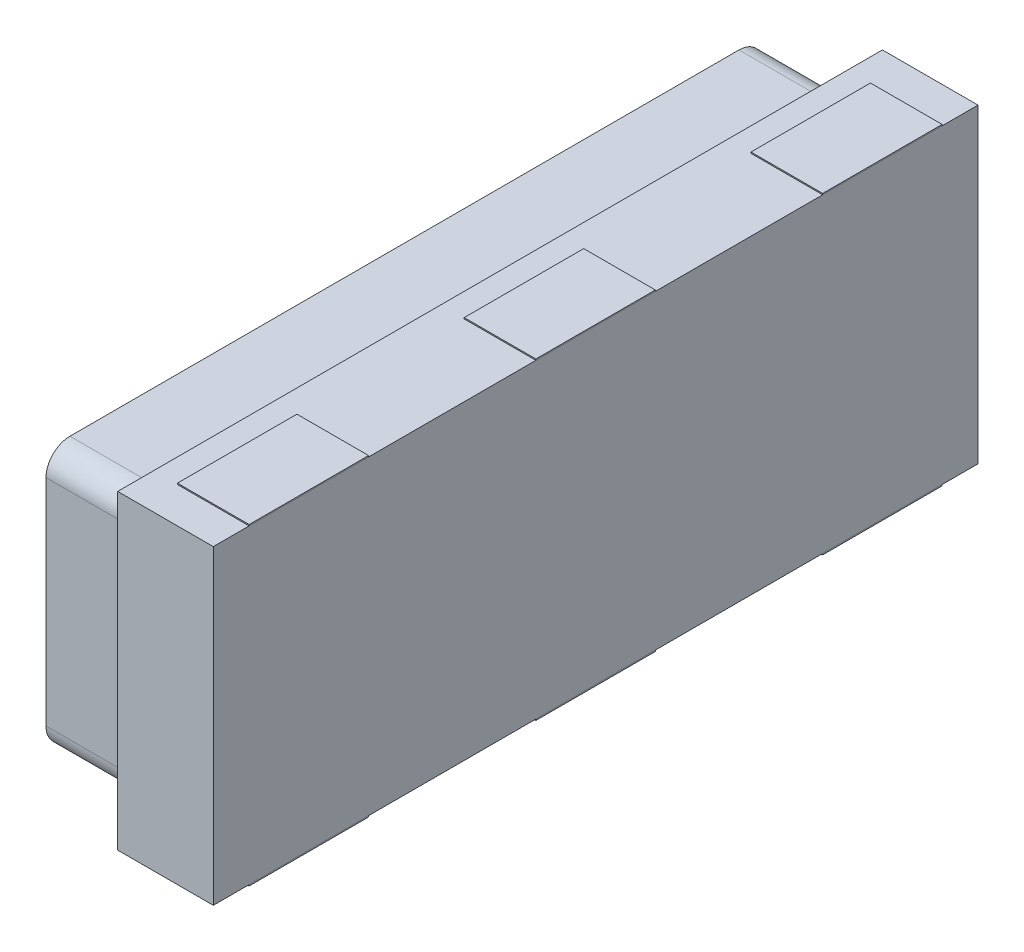
ISO-10303-21;
HEADER;
FILE_DESCRIPTION(('STEP AP214'),'2;1');
FILE_NAME('part.step','',(''),(''),'','','');
FILE_SCHEMA(('AUTOMOTIVE_DESIGN { 1 0 10303 214 1 1 1 1 }'));
ENDSEC;
DATA;
#1=APPLICATION_CONTEXT('core data for automotive mechanical design processes');
#2=APPLICATION_PROTOCOL_DEFINITION('international standard','automotive_design',2000,#1);
#3=PRODUCT_CONTEXT('',#1,'mechanical');
#4=PRODUCT('Part','Part','',(#3));
#5=PRODUCT_RELATED_PRODUCT_CATEGORY('part','',(#4));
#6=PRODUCT_DEFINITION_FORMATION('','',#4);
#7=PRODUCT_DEFINITION_CONTEXT('part definition',#1,'design');
#8=PRODUCT_DEFINITION('design','',#6,#7);
#9=PRODUCT_DEFINITION_SHAPE('','',#8);
#10=(LENGTH_UNIT() NAMED_UNIT(*) SI_UNIT(.MILLI.,.METRE.));
#11=(NAMED_UNIT(*) PLANE_ANGLE_UNIT() SI_UNIT($,.RADIAN.));
#12=(NAMED_UNIT(*) SI_UNIT($,.STERADIAN.) SOLID_ANGLE_UNIT());
#13=UNCERTAINTY_MEASURE_WITH_UNIT(LENGTH_MEASURE(1.E-05),#10,'distance_accuracy_value','');
#14=(GEOMETRIC_REPRESENTATION_CONTEXT(3) GLOBAL_UNCERTAINTY_ASSIGNED_CONTEXT((#13)) GLOBAL_UNIT_ASSIGNED_CONTEXT((#10,
#11,#12)) REPRESENTATION_CONTEXT('',''));
#15=CARTESIAN_POINT('',(0.,0.,0.));
#16=DIRECTION('',(0.,0.,1.));
#17=DIRECTION('',(1.,0.,0.));
#18=AXIS2_PLACEMENT_3D('',#15,#16,#17);
#19=CARTESIAN_POINT('',(0.1,0.655,0.95));
#20=DIRECTION('',(0.,0.,-1.));
#21=DIRECTION('',(0.,1.,0.));
#22=AXIS2_PLACEMENT_3D('',#19,#20,#21);
#23=PLANE('',#22);
#24=DIRECTION('',(0.,1.,0.));
#25=VECTOR('',#24,1.);
#26=CARTESIAN_POINT('',(0.4,0.655,0.95));
#27=LINE('',#26,#25);
#28=CARTESIAN_POINT('',(0.4,-0.655,0.95));
#29=VERTEX_POINT('',#28);
#30=CARTESIAN_POINT('',(0.4,0.655,0.95));
#31=VERTEX_POINT('',#30);
#32=EDGE_CURVE('E108',#29,#31,#27,.T.);
#33=ORIENTED_EDGE('',*,*,#32,.F.);
#34=DIRECTION('',(1.,0.,0.));
#35=VECTOR('',#34,1.);
#36=CARTESIAN_POINT('',(0.1,-0.655,0.95));
#37=LINE('',#36,#35);
#38=CARTESIAN_POINT('',(0.1,-0.655,0.95));
#39=VERTEX_POINT('',#38);
#40=EDGE_CURVE('E12',#39,#29,#37,.T.);
#41=ORIENTED_EDGE('',*,*,#40,.F.);
#42=DIRECTION('',(0.,1.,0.));
#43=VECTOR('',#42,1.);
#44=CARTESIAN_POINT('',(0.1,0.655,0.95));
#45=LINE('',#44,#43);
#46=CARTESIAN_POINT('',(0.1,0.655,0.95));
#47=VERTEX_POINT('',#46);
#48=EDGE_CURVE('E102',#39,#47,#45,.T.);
#49=ORIENTED_EDGE('',*,*,#48,.T.);
#50=DIRECTION('',(1.,0.,0.));
#51=VECTOR('',#50,1.);
#52=CARTESIAN_POINT('',(0.1,0.655,0.95));
#53=LINE('',#52,#51);
#54=EDGE_CURVE('E47',#47,#31,#53,.T.);
#55=ORIENTED_EDGE('',*,*,#54,.T.);
#56=EDGE_LOOP('',(#33,#41,#49,#55));
#57=FACE_BOUND('',#56,.T.);
#58=ADVANCED_FACE('F44',(#57),#23,.T.);
#59=CARTESIAN_POINT('',(0.1,-0.655,1.45));
#60=DIRECTION('',(0.,-1.,0.));
#61=DIRECTION('',(0.,0.,-1.));
#62=AXIS2_PLACEMENT_3D('',#59,#60,#61);
#63=PLANE('',#62);
#64=DIRECTION('',(0.,0.,-1.));
#65=VECTOR('',#64,1.);
#66=CARTESIAN_POINT('',(0.4,-0.655,1.45));
#67=LINE('',#66,#65);
#68=CARTESIAN_POINT('',(0.4,-0.655,1.45));
#69=VERTEX_POINT('',#68);
#70=EDGE_CURVE('E104',#69,#29,#67,.T.);
#71=ORIENTED_EDGE('',*,*,#70,.F.);
#72=DIRECTION('',(1.,0.,0.));
#73=VECTOR('',#72,1.);
#74=CARTESIAN_POINT('',(0.1,-0.655,1.45));
#75=LINE('',#74,#73);
#76=CARTESIAN_POINT('',(0.1,-0.655,1.45));
#77=VERTEX_POINT('',#76);
#78=EDGE_CURVE('E53',#77,#69,#75,.T.);
#79=ORIENTED_EDGE('',*,*,#78,.F.);
#80=DIRECTION('',(0.,0.,-1.));
#81=VECTOR('',#80,1.);
#82=CARTESIAN_POINT('',(0.1,-0.655,1.45));
#83=LINE('',#82,#81);
#84=EDGE_CURVE('E99',#77,#39,#83,.T.);
#85=ORIENTED_EDGE('',*,*,#84,.T.);
#86=ORIENTED_EDGE('',*,*,#40,.T.);
#87=EDGE_LOOP('',(#71,#79,#85,#86));
#88=FACE_BOUND('',#87,.T.);
#89=ADVANCED_FACE('F118',(#88),#63,.T.);
#90=CARTESIAN_POINT('',(0.1,0.655,1.45));
#91=DIRECTION('',(0.,0.,1.));
#92=DIRECTION('',(1.,0.,0.));
#93=AXIS2_PLACEMENT_3D('',#90,#91,#92);
#94=PLANE('',#93);
#95=DIRECTION('',(0.,-1.,0.));
#96=VECTOR('',#95,1.);
#97=CARTESIAN_POINT('',(0.4,0.655,1.45));
#98=LINE('',#97,#96);
#99=CARTESIAN_POINT('',(0.4,0.655,1.45));
#100=VERTEX_POINT('',#99);
#101=EDGE_CURVE('E94',#100,#69,#98,.T.);
#102=ORIENTED_EDGE('',*,*,#101,.F.);
#103=DIRECTION('',(1.,0.,0.));
#104=VECTOR('',#103,1.);
#105=CARTESIAN_POINT('',(0.1,0.655,1.45));
#106=LINE('',#105,#104);
#107=CARTESIAN_POINT('',(0.1,0.655,1.45));
#108=VERTEX_POINT('',#107);
#109=EDGE_CURVE('E89',#108,#100,#106,.T.);
#110=ORIENTED_EDGE('',*,*,#109,.F.);
#111=DIRECTION('',(0.,-1.,0.));
#112=VECTOR('',#111,1.);
#113=CARTESIAN_POINT('',(0.1,0.655,1.45));
#114=LINE('',#113,#112);
#115=EDGE_CURVE('E92',#108,#77,#114,.T.);
#116=ORIENTED_EDGE('',*,*,#115,.T.);
#117=ORIENTED_EDGE('',*,*,#78,.T.);
#118=EDGE_LOOP('',(#102,#110,#116,#117));
#119=FACE_BOUND('',#118,.T.);
#120=ADVANCED_FACE('F91',(#119),#94,.T.);
#121=CARTESIAN_POINT('',(0.1,0.655,1.45));
#122=DIRECTION('',(0.,1.,0.));
#123=DIRECTION('',(0.,0.,1.));
#124=AXIS2_PLACEMENT_3D('',#121,#122,#123);
#125=PLANE('',#124);
#126=DIRECTION('',(0.,0.,1.));
#127=VECTOR('',#126,1.);
#128=CARTESIAN_POINT('',(0.4,0.655,1.45));
#129=LINE('',#128,#127);
#130=EDGE_CURVE('E111',#31,#100,#129,.T.);
#131=ORIENTED_EDGE('',*,*,#130,.F.);
#132=ORIENTED_EDGE('',*,*,#54,.F.);
#133=DIRECTION('',(0.,0.,1.));
#134=VECTOR('',#133,1.);
#135=CARTESIAN_POINT('',(0.1,0.655,1.45));
#136=LINE('',#135,#134);
#137=EDGE_CURVE('E98',#47,#108,#136,.T.);
#138=ORIENTED_EDGE('',*,*,#137,.T.);
#139=ORIENTED_EDGE('',*,*,#109,.T.);
#140=EDGE_LOOP('',(#131,#132,#138,#139));
#141=FACE_BOUND('',#140,.T.);
#142=ADVANCED_FACE('F101',(#141),#125,.T.);
#143=CARTESIAN_POINT('',(0.1,0.,0.));
#144=DIRECTION('',(1.,0.,0.));
#145=DIRECTION('',(0.,0.,-1.));
#146=AXIS2_PLACEMENT_3D('',#143,#144,#145);
#147=PLANE('',#146);
#148=ORIENTED_EDGE('',*,*,#48,.F.);
#149=ORIENTED_EDGE('',*,*,#84,.F.);
#150=ORIENTED_EDGE('',*,*,#115,.F.);
#151=ORIENTED_EDGE('',*,*,#137,.F.);
#152=EDGE_LOOP('',(#148,#149,#150,#151));
#153=FACE_BOUND('',#152,.T.);
#154=ADVANCED_FACE('F97',(#153),#147,.F.);
#155=CARTESIAN_POINT('',(0.4,0.,0.));
#156=DIRECTION('',(1.,0.,0.));
#157=DIRECTION('',(0.,0.,-1.));
#158=AXIS2_PLACEMENT_3D('',#155,#156,#157);
#159=PLANE('',#158);
#160=ORIENTED_EDGE('',*,*,#32,.T.);
#161=ORIENTED_EDGE('',*,*,#130,.T.);
#162=ORIENTED_EDGE('',*,*,#101,.T.);
#163=ORIENTED_EDGE('',*,*,#70,.T.);
#164=EDGE_LOOP('',(#160,#161,#162,#163));
#165=FACE_BOUND('',#164,.T.);
#166=ADVANCED_FACE('F117',(#165),#159,.T.);
#167=CLOSED_SHELL('',(#58,#89,#120,#142,#154,#166));
#168=MANIFOLD_SOLID_BREP('B2',#167);
#169=CARTESIAN_POINT('',(0.1,0.655000000000001,-1.45));
#170=DIRECTION('',(0.,0.,-1.));
#171=DIRECTION('',(-1.,0.,0.));
#172=AXIS2_PLACEMENT_3D('',#169,#170,#171);
#173=PLANE('',#172);
#174=DIRECTION('',(0.,1.,0.));
#175=VECTOR('',#174,1.);
#176=CARTESIAN_POINT('',(0.4,0.655000000000001,-1.45));
#177=LINE('',#176,#175);
#178=CARTESIAN_POINT('',(0.4,-0.654999999999999,-1.45));
#179=VERTEX_POINT('',#178);
#180=CARTESIAN_POINT('',(0.4,0.655000000000001,-1.45));
#181=VERTEX_POINT('',#180);
#182=EDGE_CURVE('E242',#179,#181,#177,.T.);
#183=ORIENTED_EDGE('',*,*,#182,.F.);
#184=DIRECTION('',(1.,0.,0.));
#185=VECTOR('',#184,1.);
#186=CARTESIAN_POINT('',(0.1,-0.654999999999999,-1.45));
#187=LINE('',#186,#185);
#188=CARTESIAN_POINT('',(0.1,-0.654999999999999,-1.45));
#189=VERTEX_POINT('',#188);
#190=EDGE_CURVE('E42',#189,#179,#187,.T.);
#191=ORIENTED_EDGE('',*,*,#190,.F.);
#192=DIRECTION('',(0.,1.,0.));
#193=VECTOR('',#192,1.);
#194=CARTESIAN_POINT('',(0.1,0.655000000000001,-1.45));
#195=LINE('',#194,#193);
#196=CARTESIAN_POINT('',(0.1,0.655000000000001,-1.45));
#197=VERTEX_POINT('',#196);
#198=EDGE_CURVE('E236',#189,#197,#195,.T.);
#199=ORIENTED_EDGE('',*,*,#198,.T.);
#200=DIRECTION('',(1.,0.,0.));
#201=VECTOR('',#200,1.);
#202=CARTESIAN_POINT('',(0.1,0.655000000000001,-1.45));
#203=LINE('',#202,#201);
#204=EDGE_CURVE('E181',#197,#181,#203,.T.);
#205=ORIENTED_EDGE('',*,*,#204,.T.);
#206=EDGE_LOOP('',(#183,#191,#199,#205));
#207=FACE_BOUND('',#206,.T.);
#208=ADVANCED_FACE('F178',(#207),#173,.T.);
#209=CARTESIAN_POINT('',(0.1,-0.654999999999999,-0.95));
#210=DIRECTION('',(0.,-1.,0.));
#211=DIRECTION('',(0.,0.,-1.));
#212=AXIS2_PLACEMENT_3D('',#209,#210,#211);
#213=PLANE('',#212);
#214=DIRECTION('',(0.,0.,-1.));
#215=VECTOR('',#214,1.);
#216=CARTESIAN_POINT('',(0.4,-0.654999999999999,-0.95));
#217=LINE('',#216,#215);
#218=CARTESIAN_POINT('',(0.4,-0.654999999999999,-0.95));
#219=VERTEX_POINT('',#218);
#220=EDGE_CURVE('E238',#219,#179,#217,.T.);
#221=ORIENTED_EDGE('',*,*,#220,.F.);
#222=DIRECTION('',(1.,0.,0.));
#223=VECTOR('',#222,1.);
#224=CARTESIAN_POINT('',(0.1,-0.654999999999999,-0.95));
#225=LINE('',#224,#223);
#226=CARTESIAN_POINT('',(0.1,-0.654999999999999,-0.95));
#227=VERTEX_POINT('',#226);
#228=EDGE_CURVE('E187',#227,#219,#225,.T.);
#229=ORIENTED_EDGE('',*,*,#228,.F.);
#230=DIRECTION('',(0.,0.,-1.));
#231=VECTOR('',#230,1.);
#232=CARTESIAN_POINT('',(0.1,-0.654999999999999,-0.95));
#233=LINE('',#232,#231);
#234=EDGE_CURVE('E233',#227,#189,#233,.T.);
#235=ORIENTED_EDGE('',*,*,#234,.T.);
#236=ORIENTED_EDGE('',*,*,#190,.T.);
#237=EDGE_LOOP('',(#221,#229,#235,#236));
#238=FACE_BOUND('',#237,.T.);
#239=ADVANCED_FACE('F252',(#238),#213,.T.);
#240=CARTESIAN_POINT('',(0.1,0.655000000000001,-0.95));
#241=DIRECTION('',(0.,0.,1.));
#242=DIRECTION('',(0.,-1.,0.));
#243=AXIS2_PLACEMENT_3D('',#240,#241,#242);
#244=PLANE('',#243);
#245=DIRECTION('',(0.,-1.,0.));
#246=VECTOR('',#245,1.);
#247=CARTESIAN_POINT('',(0.4,0.655000000000001,-0.95));
#248=LINE('',#247,#246);
#249=CARTESIAN_POINT('',(0.4,0.655000000000001,-0.95));
#250=VERTEX_POINT('',#249);
#251=EDGE_CURVE('E228',#250,#219,#248,.T.);
#252=ORIENTED_EDGE('',*,*,#251,.F.);
#253=DIRECTION('',(1.,0.,0.));
#254=VECTOR('',#253,1.);
#255=CARTESIAN_POINT('',(0.1,0.655000000000001,-0.95));
#256=LINE('',#255,#254);
#257=CARTESIAN_POINT('',(0.1,0.655000000000001,-0.95));
#258=VERTEX_POINT('',#257);
#259=EDGE_CURVE('E223',#258,#250,#256,.T.);
#260=ORIENTED_EDGE('',*,*,#259,.F.);
#261=DIRECTION('',(0.,-1.,0.));
#262=VECTOR('',#261,1.);
#263=CARTESIAN_POINT('',(0.1,0.655000000000001,-0.95));
#264=LINE('',#263,#262);
#265=EDGE_CURVE('E226',#258,#227,#264,.T.);
#266=ORIENTED_EDGE('',*,*,#265,.T.);
#267=ORIENTED_EDGE('',*,*,#228,.T.);
#268=EDGE_LOOP('',(#252,#260,#266,#267));
#269=FACE_BOUND('',#268,.T.);
#270=ADVANCED_FACE('F225',(#269),#244,.T.);
#271=CARTESIAN_POINT('',(0.1,0.655000000000001,-0.95));
#272=DIRECTION('',(0.,1.,0.));
#273=DIRECTION('',(0.,0.,1.));
#274=AXIS2_PLACEMENT_3D('',#271,#272,#273);
#275=PLANE('',#274);
#276=DIRECTION('',(0.,0.,1.));
#277=VECTOR('',#276,1.);
#278=CARTESIAN_POINT('',(0.4,0.655000000000001,-0.95));
#279=LINE('',#278,#277);
#280=EDGE_CURVE('E245',#181,#250,#279,.T.);
#281=ORIENTED_EDGE('',*,*,#280,.F.);
#282=ORIENTED_EDGE('',*,*,#204,.F.);
#283=DIRECTION('',(0.,0.,1.));
#284=VECTOR('',#283,1.);
#285=CARTESIAN_POINT('',(0.1,0.655000000000001,-0.95));
#286=LINE('',#285,#284);
#287=EDGE_CURVE('E232',#197,#258,#286,.T.);
#288=ORIENTED_EDGE('',*,*,#287,.T.);
#289=ORIENTED_EDGE('',*,*,#259,.T.);
#290=EDGE_LOOP('',(#281,#282,#288,#289));
#291=FACE_BOUND('',#290,.T.);
#292=ADVANCED_FACE('F235',(#291),#275,.T.);
#293=CARTESIAN_POINT('',(0.1,0.,0.));
#294=DIRECTION('',(1.,0.,0.));
#295=DIRECTION('',(0.,0.,-1.));
#296=AXIS2_PLACEMENT_3D('',#293,#294,#295);
#297=PLANE('',#296);
#298=ORIENTED_EDGE('',*,*,#198,.F.);
#299=ORIENTED_EDGE('',*,*,#234,.F.);
#300=ORIENTED_EDGE('',*,*,#265,.F.);
#301=ORIENTED_EDGE('',*,*,#287,.F.);
#302=EDGE_LOOP('',(#298,#299,#300,#301));
#303=FACE_BOUND('',#302,.T.);
#304=ADVANCED_FACE('F231',(#303),#297,.F.);
#305=CARTESIAN_POINT('',(0.4,0.,0.));
#306=DIRECTION('',(1.,0.,0.));
#307=DIRECTION('',(0.,0.,-1.));
#308=AXIS2_PLACEMENT_3D('',#305,#306,#307);
#309=PLANE('',#308);
#310=ORIENTED_EDGE('',*,*,#182,.T.);
#311=ORIENTED_EDGE('',*,*,#280,.T.);
#312=ORIENTED_EDGE('',*,*,#251,.T.);
#313=ORIENTED_EDGE('',*,*,#220,.T.);
#314=EDGE_LOOP('',(#310,#311,#312,#313));
#315=FACE_BOUND('',#314,.T.);
#316=ADVANCED_FACE('F251',(#315),#309,.T.);
#317=CLOSED_SHELL('',(#208,#239,#270,#292,#304,#316));
#318=MANIFOLD_SOLID_BREP('B6',#317);
#319=CARTESIAN_POINT('',(0.1,0.655,-0.25));
#320=DIRECTION('',(0.,0.,-1.));
#321=DIRECTION('',(0.,1.,0.));
#322=AXIS2_PLACEMENT_3D('',#319,#320,#321);
#323=PLANE('',#322);
#324=DIRECTION('',(0.,1.,0.));
#325=VECTOR('',#324,1.);
#326=CARTESIAN_POINT('',(0.4,0.655,-0.25));
#327=LINE('',#326,#325);
#328=CARTESIAN_POINT('',(0.4,-0.655,-0.25));
#329=VERTEX_POINT('',#328);
#330=CARTESIAN_POINT('',(0.4,0.655,-0.25));
#331=VERTEX_POINT('',#330);
#332=EDGE_CURVE('E376',#329,#331,#327,.T.);
#333=ORIENTED_EDGE('',*,*,#332,.F.);
#334=DIRECTION('',(1.,0.,0.));
#335=VECTOR('',#334,1.);
#336=CARTESIAN_POINT('',(0.1,-0.655,-0.25));
#337=LINE('',#336,#335);
#338=CARTESIAN_POINT('',(0.1,-0.655,-0.25));
#339=VERTEX_POINT('',#338);
#340=EDGE_CURVE('E176',#339,#329,#337,.T.);
#341=ORIENTED_EDGE('',*,*,#340,.F.);
#342=DIRECTION('',(0.,1.,0.));
#343=VECTOR('',#342,1.);
#344=CARTESIAN_POINT('',(0.1,0.655,-0.25));
#345=LINE('',#344,#343);
#346=CARTESIAN_POINT('',(0.1,0.655,-0.25));
#347=VERTEX_POINT('',#346);
#348=EDGE_CURVE('E370',#339,#347,#345,.T.);
#349=ORIENTED_EDGE('',*,*,#348,.T.);
#350=DIRECTION('',(1.,0.,0.));
#351=VECTOR('',#350,1.);
#352=CARTESIAN_POINT('',(0.1,0.655,-0.25));
#353=LINE('',#352,#351);
#354=EDGE_CURVE('E315',#347,#331,#353,.T.);
#355=ORIENTED_EDGE('',*,*,#354,.T.);
#356=EDGE_LOOP('',(#333,#341,#349,#355));
#357=FACE_BOUND('',#356,.T.);
#358=ADVANCED_FACE('F312',(#357),#323,.T.);
#359=CARTESIAN_POINT('',(0.1,-0.655,0.25));
#360=DIRECTION('',(0.,-1.,0.));
#361=DIRECTION('',(0.,0.,-1.));
#362=AXIS2_PLACEMENT_3D('',#359,#360,#361);
#363=PLANE('',#362);
#364=DIRECTION('',(0.,0.,-1.));
#365=VECTOR('',#364,1.);
#366=CARTESIAN_POINT('',(0.4,-0.655,0.25));
#367=LINE('',#366,#365);
#368=CARTESIAN_POINT('',(0.4,-0.655,0.25));
#369=VERTEX_POINT('',#368);
#370=EDGE_CURVE('E372',#369,#329,#367,.T.);
#371=ORIENTED_EDGE('',*,*,#370,.F.);
#372=DIRECTION('',(1.,0.,0.));
#373=VECTOR('',#372,1.);
#374=CARTESIAN_POINT('',(0.1,-0.655,0.25));
#375=LINE('',#374,#373);
#376=CARTESIAN_POINT('',(0.1,-0.655,0.25));
#377=VERTEX_POINT('',#376);
#378=EDGE_CURVE('E321',#377,#369,#375,.T.);
#379=ORIENTED_EDGE('',*,*,#378,.F.);
#380=DIRECTION('',(0.,0.,-1.));
#381=VECTOR('',#380,1.);
#382=CARTESIAN_POINT('',(0.1,-0.655,0.25));
#383=LINE('',#382,#381);
#384=EDGE_CURVE('E367',#377,#339,#383,.T.);
#385=ORIENTED_EDGE('',*,*,#384,.T.);
#386=ORIENTED_EDGE('',*,*,#340,.T.);
#387=EDGE_LOOP('',(#371,#379,#385,#386));
#388=FACE_BOUND('',#387,.T.);
#389=ADVANCED_FACE('F386',(#388),#363,.T.);
#390=CARTESIAN_POINT('',(0.1,0.655,0.25));
#391=DIRECTION('',(0.,0.,1.));
#392=DIRECTION('',(0.,-1.,0.));
#393=AXIS2_PLACEMENT_3D('',#390,#391,#392);
#394=PLANE('',#393);
#395=DIRECTION('',(0.,-1.,0.));
#396=VECTOR('',#395,1.);
#397=CARTESIAN_POINT('',(0.4,0.655,0.25));
#398=LINE('',#397,#396);
#399=CARTESIAN_POINT('',(0.4,0.655,0.25));
#400=VERTEX_POINT('',#399);
#401=EDGE_CURVE('E362',#400,#369,#398,.T.);
#402=ORIENTED_EDGE('',*,*,#401,.F.);
#403=DIRECTION('',(1.,0.,0.));
#404=VECTOR('',#403,1.);
#405=CARTESIAN_POINT('',(0.1,0.655,0.25));
#406=LINE('',#405,#404);
#407=CARTESIAN_POINT('',(0.1,0.655,0.25));
#408=VERTEX_POINT('',#407);
#409=EDGE_CURVE('E357',#408,#400,#406,.T.);
#410=ORIENTED_EDGE('',*,*,#409,.F.);
#411=DIRECTION('',(0.,-1.,0.));
#412=VECTOR('',#411,1.);
#413=CARTESIAN_POINT('',(0.1,0.655,0.25));
#414=LINE('',#413,#412);
#415=EDGE_CURVE('E360',#408,#377,#414,.T.);
#416=ORIENTED_EDGE('',*,*,#415,.T.);
#417=ORIENTED_EDGE('',*,*,#378,.T.);
#418=EDGE_LOOP('',(#402,#410,#416,#417));
#419=FACE_BOUND('',#418,.T.);
#420=ADVANCED_FACE('F359',(#419),#394,.T.);
#421=CARTESIAN_POINT('',(0.1,0.655,0.25));
#422=DIRECTION('',(0.,1.,0.));
#423=DIRECTION('',(0.,0.,1.));
#424=AXIS2_PLACEMENT_3D('',#421,#422,#423);
#425=PLANE('',#424);
#426=DIRECTION('',(0.,0.,1.));
#427=VECTOR('',#426,1.);
#428=CARTESIAN_POINT('',(0.4,0.655,0.25));
#429=LINE('',#428,#427);
#430=EDGE_CURVE('E379',#331,#400,#429,.T.);
#431=ORIENTED_EDGE('',*,*,#430,.F.);
#432=ORIENTED_EDGE('',*,*,#354,.F.);
#433=DIRECTION('',(0.,0.,1.));
#434=VECTOR('',#433,1.);
#435=CARTESIAN_POINT('',(0.1,0.655,0.25));
#436=LINE('',#435,#434);
#437=EDGE_CURVE('E366',#347,#408,#436,.T.);
#438=ORIENTED_EDGE('',*,*,#437,.T.);
#439=ORIENTED_EDGE('',*,*,#409,.T.);
#440=EDGE_LOOP('',(#431,#432,#438,#439));
#441=FACE_BOUND('',#440,.T.);
#442=ADVANCED_FACE('F369',(#441),#425,.T.);
#443=CARTESIAN_POINT('',(0.1,0.,0.));
#444=DIRECTION('',(1.,0.,0.));
#445=DIRECTION('',(0.,0.,-1.));
#446=AXIS2_PLACEMENT_3D('',#443,#444,#445);
#447=PLANE('',#446);
#448=ORIENTED_EDGE('',*,*,#348,.F.);
#449=ORIENTED_EDGE('',*,*,#384,.F.);
#450=ORIENTED_EDGE('',*,*,#415,.F.);
#451=ORIENTED_EDGE('',*,*,#437,.F.);
#452=EDGE_LOOP('',(#448,#449,#450,#451));
#453=FACE_BOUND('',#452,.T.);
#454=ADVANCED_FACE('F365',(#453),#447,.F.);
#455=CARTESIAN_POINT('',(0.4,0.,0.));
#456=DIRECTION('',(1.,0.,0.));
#457=DIRECTION('',(0.,0.,-1.));
#458=AXIS2_PLACEMENT_3D('',#455,#456,#457);
#459=PLANE('',#458);
#460=ORIENTED_EDGE('',*,*,#332,.T.);
#461=ORIENTED_EDGE('',*,*,#430,.T.);
#462=ORIENTED_EDGE('',*,*,#401,.T.);
#463=ORIENTED_EDGE('',*,*,#370,.T.);
#464=EDGE_LOOP('',(#460,#461,#462,#463));
#465=FACE_BOUND('',#464,.T.);
#466=ADVANCED_FACE('F385',(#465),#459,.T.);
#467=CLOSED_SHELL('',(#358,#389,#420,#442,#454,#466));
#468=MANIFOLD_SOLID_BREP('B36',#467);
#469=CARTESIAN_POINT('',(-0.4,0.45,1.4));
#470=DIRECTION('',(1.,0.,0.));
#471=DIRECTION('',(0.,0.,-1.));
#472=AXIS2_PLACEMENT_3D('',#469,#470,#471);
#473=CYLINDRICAL_SURFACE('',#472,0.1);
#474=CARTESIAN_POINT('',(0.,0.45,1.4));
#475=DIRECTION('',(-1.,0.,0.));
#476=DIRECTION('',(0.,0.,-1.));
#477=AXIS2_PLACEMENT_3D('',#474,#475,#476);
#478=CIRCLE('',#477,0.1);
#479=CARTESIAN_POINT('',(0.,0.449999999999999,1.5));
#480=VERTEX_POINT('',#479);
#481=CARTESIAN_POINT('',(0.,0.55,1.4));
#482=VERTEX_POINT('',#481);
#483=EDGE_CURVE('E541',#480,#482,#478,.T.);
#484=ORIENTED_EDGE('',*,*,#483,.T.);
#485=DIRECTION('',(1.,0.,0.));
#486=VECTOR('',#485,1.);
#487=CARTESIAN_POINT('',(-0.4,0.55,1.4));
#488=LINE('',#487,#486);
#489=CARTESIAN_POINT('',(-0.4,0.55,1.4));
#490=VERTEX_POINT('',#489);
#491=EDGE_CURVE('E310',#490,#482,#488,.T.);
#492=ORIENTED_EDGE('',*,*,#491,.F.);
#493=CARTESIAN_POINT('',(-0.4,0.45,1.4));
#494=DIRECTION('',(-1.,0.,0.));
#495=DIRECTION('',(0.,0.,-1.));
#496=AXIS2_PLACEMENT_3D('',#493,#494,#495);
#497=CIRCLE('',#496,0.1);
#498=CARTESIAN_POINT('',(-0.4,0.449999999999999,1.5));
#499=VERTEX_POINT('',#498);
#500=EDGE_CURVE('E555',#499,#490,#497,.T.);
#501=ORIENTED_EDGE('',*,*,#500,.F.);
#502=DIRECTION('',(1.,0.,0.));
#503=VECTOR('',#502,1.);
#504=CARTESIAN_POINT('',(-0.4,0.449999999999999,1.5));
#505=LINE('',#504,#503);
#506=EDGE_CURVE('E537',#499,#480,#505,.T.);
#507=ORIENTED_EDGE('',*,*,#506,.T.);
#508=EDGE_LOOP('',(#484,#492,#501,#507));
#509=FACE_BOUND('',#508,.T.);
#510=ADVANCED_FACE('F445',(#509),#473,.T.);
#511=CARTESIAN_POINT('',(-0.4,0.55,-1.4));
#512=DIRECTION('',(0.,-1.,0.));
#513=DIRECTION('',(0.,0.,-1.));
#514=AXIS2_PLACEMENT_3D('',#511,#512,#513);
#515=PLANE('',#514);
#516=DIRECTION('',(0.,0.,-1.));
#517=VECTOR('',#516,1.);
#518=CARTESIAN_POINT('',(0.,0.55,-1.4));
#519=LINE('',#518,#517);
#520=CARTESIAN_POINT('',(0.,0.55,-1.4));
#521=VERTEX_POINT('',#520);
#522=EDGE_CURVE('E544',#482,#521,#519,.T.);
#523=ORIENTED_EDGE('',*,*,#522,.T.);
#524=DIRECTION('',(1.,0.,0.));
#525=VECTOR('',#524,1.);
#526=CARTESIAN_POINT('',(-0.4,0.55,-1.4));
#527=LINE('',#526,#525);
#528=CARTESIAN_POINT('',(-0.4,0.55,-1.4));
#529=VERTEX_POINT('',#528);
#530=EDGE_CURVE('E453',#529,#521,#527,.T.);
#531=ORIENTED_EDGE('',*,*,#530,.F.);
#532=DIRECTION('',(0.,0.,-1.));
#533=VECTOR('',#532,1.);
#534=CARTESIAN_POINT('',(-0.4,0.55,-1.4));
#535=LINE('',#534,#533);
#536=EDGE_CURVE('E504',#490,#529,#535,.T.);
#537=ORIENTED_EDGE('',*,*,#536,.F.);
#538=ORIENTED_EDGE('',*,*,#491,.T.);
#539=EDGE_LOOP('',(#523,#531,#537,#538));
#540=FACE_BOUND('',#539,.T.);
#541=ADVANCED_FACE('F590',(#540),#515,.F.);
#542=CARTESIAN_POINT('',(-0.4,0.45,-1.4));
#543=DIRECTION('',(1.,0.,0.));
#544=DIRECTION('',(0.,0.,-1.));
#545=AXIS2_PLACEMENT_3D('',#542,#543,#544);
#546=CYLINDRICAL_SURFACE('',#545,0.1);
#547=CARTESIAN_POINT('',(0.,0.45,-1.4));
#548=DIRECTION('',(-1.,0.,0.));
#549=DIRECTION('',(0.,0.,1.));
#550=AXIS2_PLACEMENT_3D('',#547,#548,#549);
#551=CIRCLE('',#550,0.1);
#552=CARTESIAN_POINT('',(0.,0.449999999999999,-1.5));
#553=VERTEX_POINT('',#552);
#554=EDGE_CURVE('E546',#521,#553,#551,.T.);
#555=ORIENTED_EDGE('',*,*,#554,.T.);
#556=DIRECTION('',(1.,0.,0.));
#557=VECTOR('',#556,1.);
#558=CARTESIAN_POINT('',(-0.4,0.449999999999999,-1.5));
#559=LINE('',#558,#557);
#560=CARTESIAN_POINT('',(-0.4,0.449999999999999,-1.5));
#561=VERTEX_POINT('',#560);
#562=EDGE_CURVE('E562',#561,#553,#559,.T.);
#563=ORIENTED_EDGE('',*,*,#562,.F.);
#564=CARTESIAN_POINT('',(-0.4,0.45,-1.4));
#565=DIRECTION('',(-1.,0.,0.));
#566=DIRECTION('',(0.,0.,1.));
#567=AXIS2_PLACEMENT_3D('',#564,#565,#566);
#568=CIRCLE('',#567,0.1);
#569=EDGE_CURVE('E570',#529,#561,#568,.T.);
#570=ORIENTED_EDGE('',*,*,#569,.F.);
#571=ORIENTED_EDGE('',*,*,#530,.T.);
#572=EDGE_LOOP('',(#555,#563,#570,#571));
#573=FACE_BOUND('',#572,.T.);
#574=ADVANCED_FACE('F568',(#573),#546,.T.);
#575=CARTESIAN_POINT('',(-0.4,0.449999999999999,-1.5));
#576=DIRECTION('',(0.,0.,1.));
#577=DIRECTION('',(1.,0.,0.));
#578=AXIS2_PLACEMENT_3D('',#575,#576,#577);
#579=PLANE('',#578);
#580=DIRECTION('',(0.,-1.,0.));
#581=VECTOR('',#580,1.);
#582=CARTESIAN_POINT('',(0.,0.449999999999999,-1.5));
#583=LINE('',#582,#581);
#584=CARTESIAN_POINT('',(0.,-0.449999999999999,-1.5));
#585=VERTEX_POINT('',#584);
#586=EDGE_CURVE('E548',#553,#585,#583,.T.);
#587=ORIENTED_EDGE('',*,*,#586,.T.);
#588=DIRECTION('',(1.,0.,0.));
#589=VECTOR('',#588,1.);
#590=CARTESIAN_POINT('',(-0.4,-0.449999999999999,-1.5));
#591=LINE('',#590,#589);
#592=CARTESIAN_POINT('',(-0.4,-0.449999999999999,-1.5));
#593=VERTEX_POINT('',#592);
#594=EDGE_CURVE('E559',#593,#585,#591,.T.);
#595=ORIENTED_EDGE('',*,*,#594,.F.);
#596=DIRECTION('',(0.,-1.,0.));
#597=VECTOR('',#596,1.);
#598=CARTESIAN_POINT('',(-0.4,0.449999999999999,-1.5));
#599=LINE('',#598,#597);
#600=EDGE_CURVE('E582',#561,#593,#599,.T.);
#601=ORIENTED_EDGE('',*,*,#600,.F.);
#602=ORIENTED_EDGE('',*,*,#562,.T.);
#603=EDGE_LOOP('',(#587,#595,#601,#602));
#604=FACE_BOUND('',#603,.T.);
#605=ADVANCED_FACE('F578',(#604),#579,.F.);
#606=CARTESIAN_POINT('',(-0.4,-0.45,-1.4));
#607=DIRECTION('',(1.,0.,0.));
#608=DIRECTION('',(0.,0.,-1.));
#609=AXIS2_PLACEMENT_3D('',#606,#607,#608);
#610=CYLINDRICAL_SURFACE('',#609,0.1);
#611=CARTESIAN_POINT('',(0.,-0.45,-1.4));
#612=DIRECTION('',(-1.,0.,0.));
#613=DIRECTION('',(0.,0.,1.));
#614=AXIS2_PLACEMENT_3D('',#611,#612,#613);
#615=CIRCLE('',#614,0.1);
#616=CARTESIAN_POINT('',(0.,-0.55,-1.4));
#617=VERTEX_POINT('',#616);
#618=EDGE_CURVE('E550',#585,#617,#615,.T.);
#619=ORIENTED_EDGE('',*,*,#618,.T.);
#620=DIRECTION('',(1.,0.,0.));
#621=VECTOR('',#620,1.);
#622=CARTESIAN_POINT('',(-0.4,-0.55,-1.4));
#623=LINE('',#622,#621);
#624=CARTESIAN_POINT('',(-0.4,-0.55,-1.4));
#625=VERTEX_POINT('',#624);
#626=EDGE_CURVE('E532',#625,#617,#623,.T.);
#627=ORIENTED_EDGE('',*,*,#626,.F.);
#628=CARTESIAN_POINT('',(-0.4,-0.45,-1.4));
#629=DIRECTION('',(-1.,0.,0.));
#630=DIRECTION('',(0.,0.,1.));
#631=AXIS2_PLACEMENT_3D('',#628,#629,#630);
#632=CIRCLE('',#631,0.1);
#633=EDGE_CURVE('E523',#593,#625,#632,.T.);
#634=ORIENTED_EDGE('',*,*,#633,.F.);
#635=ORIENTED_EDGE('',*,*,#594,.T.);
#636=EDGE_LOOP('',(#619,#627,#634,#635));
#637=FACE_BOUND('',#636,.T.);
#638=ADVANCED_FACE('F581',(#637),#610,.T.);
#639=CARTESIAN_POINT('',(-0.4,-0.55,-1.4));
#640=DIRECTION('',(0.,1.,0.));
#641=DIRECTION('',(0.,0.,1.));
#642=AXIS2_PLACEMENT_3D('',#639,#640,#641);
#643=PLANE('',#642);
#644=DIRECTION('',(0.,0.,1.));
#645=VECTOR('',#644,1.);
#646=CARTESIAN_POINT('',(0.,-0.55,-1.4));
#647=LINE('',#646,#645);
#648=CARTESIAN_POINT('',(0.,-0.55,1.4));
#649=VERTEX_POINT('',#648);
#650=EDGE_CURVE('E531',#617,#649,#647,.T.);
#651=ORIENTED_EDGE('',*,*,#650,.T.);
#652=DIRECTION('',(1.,0.,0.));
#653=VECTOR('',#652,1.);
#654=CARTESIAN_POINT('',(-0.4,-0.55,1.4));
#655=LINE('',#654,#653);
#656=CARTESIAN_POINT('',(-0.4,-0.55,1.4));
#657=VERTEX_POINT('',#656);
#658=EDGE_CURVE('E528',#657,#649,#655,.T.);
#659=ORIENTED_EDGE('',*,*,#658,.F.);
#660=DIRECTION('',(0.,0.,1.));
#661=VECTOR('',#660,1.);
#662=CARTESIAN_POINT('',(-0.4,-0.55,-1.4));
#663=LINE('',#662,#661);
#664=EDGE_CURVE('E517',#625,#657,#663,.T.);
#665=ORIENTED_EDGE('',*,*,#664,.F.);
#666=ORIENTED_EDGE('',*,*,#626,.T.);
#667=EDGE_LOOP('',(#651,#659,#665,#666));
#668=FACE_BOUND('',#667,.T.);
#669=ADVANCED_FACE('F529',(#668),#643,.F.);
#670=CARTESIAN_POINT('',(-0.4,-0.45,1.4));
#671=DIRECTION('',(1.,0.,0.));
#672=DIRECTION('',(0.,0.,-1.));
#673=AXIS2_PLACEMENT_3D('',#670,#671,#672);
#674=CYLINDRICAL_SURFACE('',#673,0.1);
#675=CARTESIAN_POINT('',(0.,-0.45,1.4));
#676=DIRECTION('',(-1.,0.,0.));
#677=DIRECTION('',(0.,0.,1.));
#678=AXIS2_PLACEMENT_3D('',#675,#676,#677);
#679=CIRCLE('',#678,0.1);
#680=CARTESIAN_POINT('',(0.,-0.45,1.5));
#681=VERTEX_POINT('',#680);
#682=EDGE_CURVE('E490',#649,#681,#679,.T.);
#683=ORIENTED_EDGE('',*,*,#682,.T.);
#684=DIRECTION('',(1.,0.,0.));
#685=VECTOR('',#684,1.);
#686=CARTESIAN_POINT('',(-0.4,-0.45,1.5));
#687=LINE('',#686,#685);
#688=CARTESIAN_POINT('',(-0.4,-0.45,1.5));
#689=VERTEX_POINT('',#688);
#690=EDGE_CURVE('E533',#689,#681,#687,.T.);
#691=ORIENTED_EDGE('',*,*,#690,.F.);
#692=CARTESIAN_POINT('',(-0.4,-0.45,1.4));
#693=DIRECTION('',(-1.,0.,0.));
#694=DIRECTION('',(0.,0.,1.));
#695=AXIS2_PLACEMENT_3D('',#692,#693,#694);
#696=CIRCLE('',#695,0.1);
#697=EDGE_CURVE('E521',#657,#689,#696,.T.);
#698=ORIENTED_EDGE('',*,*,#697,.F.);
#699=ORIENTED_EDGE('',*,*,#658,.T.);
#700=EDGE_LOOP('',(#683,#691,#698,#699));
#701=FACE_BOUND('',#700,.T.);
#702=ADVANCED_FACE('F535',(#701),#674,.T.);
#703=CARTESIAN_POINT('',(-0.4,0.449999999999999,1.5));
#704=DIRECTION('',(0.,0.,-1.));
#705=DIRECTION('',(-1.,0.,0.));
#706=AXIS2_PLACEMENT_3D('',#703,#704,#705);
#707=PLANE('',#706);
#708=DIRECTION('',(0.,1.,0.));
#709=VECTOR('',#708,1.);
#710=CARTESIAN_POINT('',(0.,0.449999999999999,1.5));
#711=LINE('',#710,#709);
#712=EDGE_CURVE('E496',#681,#480,#711,.T.);
#713=ORIENTED_EDGE('',*,*,#712,.T.);
#714=ORIENTED_EDGE('',*,*,#506,.F.);
#715=DIRECTION('',(0.,1.,0.));
#716=VECTOR('',#715,1.);
#717=CARTESIAN_POINT('',(-0.4,0.449999999999999,1.5));
#718=LINE('',#717,#716);
#719=EDGE_CURVE('E461',#689,#499,#718,.T.);
#720=ORIENTED_EDGE('',*,*,#719,.F.);
#721=ORIENTED_EDGE('',*,*,#690,.T.);
#722=EDGE_LOOP('',(#713,#714,#720,#721));
#723=FACE_BOUND('',#722,.T.);
#724=ADVANCED_FACE('F606',(#723),#707,.F.);
#725=CARTESIAN_POINT('',(-0.4,0.45,1.4));
#726=DIRECTION('',(1.,0.,0.));
#727=DIRECTION('',(0.,0.,-1.));
#728=AXIS2_PLACEMENT_3D('',#725,#726,#727);
#729=PLANE('',#728);
#730=ORIENTED_EDGE('',*,*,#500,.T.);
#731=ORIENTED_EDGE('',*,*,#536,.T.);
#732=ORIENTED_EDGE('',*,*,#569,.T.);
#733=ORIENTED_EDGE('',*,*,#600,.T.);
#734=ORIENTED_EDGE('',*,*,#633,.T.);
#735=ORIENTED_EDGE('',*,*,#664,.T.);
#736=ORIENTED_EDGE('',*,*,#697,.T.);
#737=ORIENTED_EDGE('',*,*,#719,.T.);
#738=EDGE_LOOP('',(#730,#731,#732,#733,#734,#735,#736,#737));
#739=FACE_BOUND('',#738,.T.);
#740=ADVANCED_FACE('F519',(#739),#729,.F.);
#741=CARTESIAN_POINT('',(0.,0.45,1.4));
#742=DIRECTION('',(1.,0.,0.));
#743=DIRECTION('',(0.,0.,-1.));
#744=AXIS2_PLACEMENT_3D('',#741,#742,#743);
#745=PLANE('',#744);
#746=ORIENTED_EDGE('',*,*,#483,.F.);
#747=ORIENTED_EDGE('',*,*,#712,.F.);
#748=ORIENTED_EDGE('',*,*,#682,.F.);
#749=ORIENTED_EDGE('',*,*,#650,.F.);
#750=ORIENTED_EDGE('',*,*,#618,.F.);
#751=ORIENTED_EDGE('',*,*,#586,.F.);
#752=ORIENTED_EDGE('',*,*,#554,.F.);
#753=ORIENTED_EDGE('',*,*,#522,.F.);
#754=EDGE_LOOP('',(#746,#747,#748,#749,#750,#751,#752,#753));
#755=FACE_BOUND('',#754,.T.);
#756=ADVANCED_FACE('F574',(#755),#745,.T.);
#757=CLOSED_SHELL('',(#510,#541,#574,#605,#638,#669,#702,#724,#740,#756));
#758=MANIFOLD_SOLID_BREP('B170',#757);
#759=CARTESIAN_POINT('',(0.4,0.65,1.6));
#760=DIRECTION('',(0.,0.,-1.));
#761=DIRECTION('',(0.,1.,0.));
#762=AXIS2_PLACEMENT_3D('',#759,#760,#761);
#763=PLANE('',#762);
#764=DIRECTION('',(0.,-1.,0.));
#765=VECTOR('',#764,1.);
#766=CARTESIAN_POINT('',(0.,0.65,1.6));
#767=LINE('',#766,#765);
#768=CARTESIAN_POINT('',(0.,0.65,1.6));
#769=VERTEX_POINT('',#768);
#770=CARTESIAN_POINT('',(0.,-0.65,1.6));
#771=VERTEX_POINT('',#770);
#772=EDGE_CURVE('E736',#769,#771,#767,.T.);
#773=ORIENTED_EDGE('',*,*,#772,.T.);
#774=DIRECTION('',(-1.,0.,0.));
#775=VECTOR('',#774,1.);
#776=CARTESIAN_POINT('',(0.4,-0.65,1.6));
#777=LINE('',#776,#775);
#778=CARTESIAN_POINT('',(0.4,-0.65,1.6));
#779=VERTEX_POINT('',#778);
#780=EDGE_CURVE('E443',#779,#771,#777,.T.);
#781=ORIENTED_EDGE('',*,*,#780,.F.);
#782=DIRECTION('',(0.,-1.,0.));
#783=VECTOR('',#782,1.);
#784=CARTESIAN_POINT('',(0.4,0.65,1.6));
#785=LINE('',#784,#783);
#786=CARTESIAN_POINT('',(0.4,0.65,1.6));
#787=VERTEX_POINT('',#786);
#788=EDGE_CURVE('E724',#787,#779,#785,.T.);
#789=ORIENTED_EDGE('',*,*,#788,.F.);
#790=DIRECTION('',(-1.,0.,0.));
#791=VECTOR('',#790,1.);
#792=CARTESIAN_POINT('',(0.4,0.65,1.6));
#793=LINE('',#792,#791);
#794=EDGE_CURVE('E732',#787,#769,#793,.T.);
#795=ORIENTED_EDGE('',*,*,#794,.T.);
#796=EDGE_LOOP('',(#773,#781,#789,#795));
#797=FACE_BOUND('',#796,.T.);
#798=ADVANCED_FACE('F673',(#797),#763,.F.);
#799=CARTESIAN_POINT('',(0.4,-0.65,-1.6));
#800=DIRECTION('',(0.,1.,0.));
#801=DIRECTION('',(0.,0.,1.));
#802=AXIS2_PLACEMENT_3D('',#799,#800,#801);
#803=PLANE('',#802);
#804=DIRECTION('',(0.,0.,-1.));
#805=VECTOR('',#804,1.);
#806=CARTESIAN_POINT('',(0.,-0.65,-1.6));
#807=LINE('',#806,#805);
#808=CARTESIAN_POINT('',(0.,-0.65,-1.6));
#809=VERTEX_POINT('',#808);
#810=EDGE_CURVE('E728',#771,#809,#807,.T.);
#811=ORIENTED_EDGE('',*,*,#810,.T.);
#812=DIRECTION('',(-1.,0.,0.));
#813=VECTOR('',#812,1.);
#814=CARTESIAN_POINT('',(0.4,-0.65,-1.6));
#815=LINE('',#814,#813);
#816=CARTESIAN_POINT('',(0.4,-0.65,-1.6));
#817=VERTEX_POINT('',#816);
#818=EDGE_CURVE('E681',#817,#809,#815,.T.);
#819=ORIENTED_EDGE('',*,*,#818,.F.);
#820=DIRECTION('',(0.,0.,-1.));
#821=VECTOR('',#820,1.);
#822=CARTESIAN_POINT('',(0.4,-0.65,-1.6));
#823=LINE('',#822,#821);
#824=EDGE_CURVE('E719',#779,#817,#823,.T.);
#825=ORIENTED_EDGE('',*,*,#824,.F.);
#826=ORIENTED_EDGE('',*,*,#780,.T.);
#827=EDGE_LOOP('',(#811,#819,#825,#826));
#828=FACE_BOUND('',#827,.T.);
#829=ADVANCED_FACE('F727',(#828),#803,.F.);
#830=CARTESIAN_POINT('',(0.4,0.65,-1.6));
#831=DIRECTION('',(0.,0.,1.));
#832=DIRECTION('',(0.,-1.,0.));
#833=AXIS2_PLACEMENT_3D('',#830,#831,#832);
#834=PLANE('',#833);
#835=DIRECTION('',(0.,1.,0.));
#836=VECTOR('',#835,1.);
#837=CARTESIAN_POINT('',(0.,0.65,-1.6));
#838=LINE('',#837,#836);
#839=CARTESIAN_POINT('',(0.,0.65,-1.6));
#840=VERTEX_POINT('',#839);
#841=EDGE_CURVE('E706',#809,#840,#838,.T.);
#842=ORIENTED_EDGE('',*,*,#841,.T.);
#843=DIRECTION('',(-1.,0.,0.));
#844=VECTOR('',#843,1.);
#845=CARTESIAN_POINT('',(0.4,0.65,-1.6));
#846=LINE('',#845,#844);
#847=CARTESIAN_POINT('',(0.4,0.65,-1.6));
#848=VERTEX_POINT('',#847);
#849=EDGE_CURVE('E729',#848,#840,#846,.T.);
#850=ORIENTED_EDGE('',*,*,#849,.F.);
#851=DIRECTION('',(0.,1.,0.));
#852=VECTOR('',#851,1.);
#853=CARTESIAN_POINT('',(0.4,0.65,-1.6));
#854=LINE('',#853,#852);
#855=EDGE_CURVE('E722',#817,#848,#854,.T.);
#856=ORIENTED_EDGE('',*,*,#855,.F.);
#857=ORIENTED_EDGE('',*,*,#818,.T.);
#858=EDGE_LOOP('',(#842,#850,#856,#857));
#859=FACE_BOUND('',#858,.T.);
#860=ADVANCED_FACE('F730',(#859),#834,.F.);
#861=CARTESIAN_POINT('',(0.4,0.65,-1.6));
#862=DIRECTION('',(0.,-1.,0.));
#863=DIRECTION('',(0.,0.,-1.));
#864=AXIS2_PLACEMENT_3D('',#861,#862,#863);
#865=PLANE('',#864);
#866=DIRECTION('',(0.,0.,1.));
#867=VECTOR('',#866,1.);
#868=CARTESIAN_POINT('',(0.,0.65,-1.6));
#869=LINE('',#868,#867);
#870=EDGE_CURVE('E712',#840,#769,#869,.T.);
#871=ORIENTED_EDGE('',*,*,#870,.T.);
#872=ORIENTED_EDGE('',*,*,#794,.F.);
#873=DIRECTION('',(0.,0.,1.));
#874=VECTOR('',#873,1.);
#875=CARTESIAN_POINT('',(0.4,0.65,-1.6));
#876=LINE('',#875,#874);
#877=EDGE_CURVE('E689',#848,#787,#876,.T.);
#878=ORIENTED_EDGE('',*,*,#877,.F.);
#879=ORIENTED_EDGE('',*,*,#849,.T.);
#880=EDGE_LOOP('',(#871,#872,#878,#879));
#881=FACE_BOUND('',#880,.T.);
#882=ADVANCED_FACE('F743',(#881),#865,.F.);
#883=CARTESIAN_POINT('',(0.4,0.,0.));
#884=DIRECTION('',(-1.,0.,0.));
#885=DIRECTION('',(0.,0.,1.));
#886=AXIS2_PLACEMENT_3D('',#883,#884,#885);
#887=PLANE('',#886);
#888=ORIENTED_EDGE('',*,*,#788,.T.);
#889=ORIENTED_EDGE('',*,*,#824,.T.);
#890=ORIENTED_EDGE('',*,*,#855,.T.);
#891=ORIENTED_EDGE('',*,*,#877,.T.);
#892=EDGE_LOOP('',(#888,#889,#890,#891));
#893=FACE_BOUND('',#892,.T.);
#894=ADVANCED_FACE('F720',(#893),#887,.F.);
#895=CARTESIAN_POINT('',(0.,0.,0.));
#896=DIRECTION('',(-1.,0.,0.));
#897=DIRECTION('',(0.,0.,1.));
#898=AXIS2_PLACEMENT_3D('',#895,#896,#897);
#899=PLANE('',#898);
#900=ORIENTED_EDGE('',*,*,#772,.F.);
#901=ORIENTED_EDGE('',*,*,#870,.F.);
#902=ORIENTED_EDGE('',*,*,#841,.F.);
#903=ORIENTED_EDGE('',*,*,#810,.F.);
#904=EDGE_LOOP('',(#900,#901,#902,#903));
#905=FACE_BOUND('',#904,.T.);
#906=ADVANCED_FACE('F746',(#905),#899,.T.);
#907=CLOSED_SHELL('',(#798,#829,#860,#882,#894,#906));
#908=MANIFOLD_SOLID_BREP('B304',#907);
#909=ADVANCED_BREP_SHAPE_REPRESENTATION('',(#18,#168,#318,#468,#758,#908),#14);
#910=SHAPE_DEFINITION_REPRESENTATION(#9,#909);
ENDSEC;
END-ISO-10303-21;
